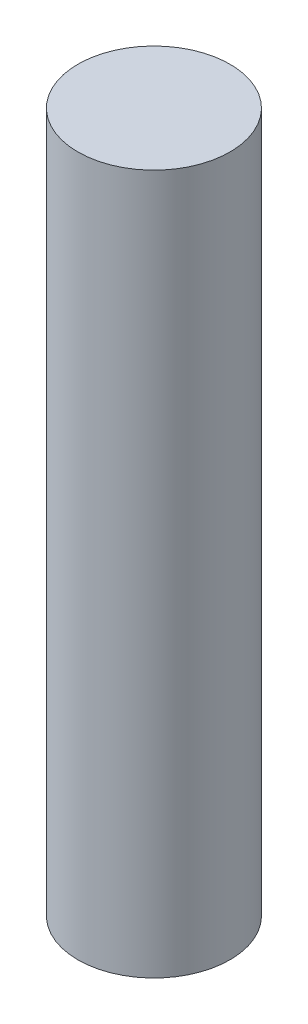
ISO-10303-21;
HEADER;
FILE_DESCRIPTION(('STEP AP214'),'2;1');
FILE_NAME('part.step','',(''),(''),'','','');
FILE_SCHEMA(('AUTOMOTIVE_DESIGN { 1 0 10303 214 1 1 1 1 }'));
ENDSEC;
DATA;
#1=APPLICATION_CONTEXT('core data for automotive mechanical design processes');
#2=APPLICATION_PROTOCOL_DEFINITION('international standard','automotive_design',2000,#1);
#3=PRODUCT_CONTEXT('',#1,'mechanical');
#4=PRODUCT('Part','Part','',(#3));
#5=PRODUCT_RELATED_PRODUCT_CATEGORY('part','',(#4));
#6=PRODUCT_DEFINITION_FORMATION('','',#4);
#7=PRODUCT_DEFINITION_CONTEXT('part definition',#1,'design');
#8=PRODUCT_DEFINITION('design','',#6,#7);
#9=PRODUCT_DEFINITION_SHAPE('','',#8);
#10=(LENGTH_UNIT() NAMED_UNIT(*) SI_UNIT(.MILLI.,.METRE.));
#11=(NAMED_UNIT(*) PLANE_ANGLE_UNIT() SI_UNIT($,.RADIAN.));
#12=(NAMED_UNIT(*) SI_UNIT($,.STERADIAN.) SOLID_ANGLE_UNIT());
#13=UNCERTAINTY_MEASURE_WITH_UNIT(LENGTH_MEASURE(1.E-05),#10,'distance_accuracy_value','');
#14=(GEOMETRIC_REPRESENTATION_CONTEXT(3) GLOBAL_UNCERTAINTY_ASSIGNED_CONTEXT((#13)) GLOBAL_UNIT_ASSIGNED_CONTEXT((#10,
#11,#12)) REPRESENTATION_CONTEXT('',''));
#15=CARTESIAN_POINT('',(0.,0.,0.));
#16=DIRECTION('',(0.,0.,1.));
#17=DIRECTION('',(1.,0.,0.));
#18=AXIS2_PLACEMENT_3D('',#15,#16,#17);
#19=CARTESIAN_POINT('',(0.,6.9,0.));
#20=DIRECTION('',(0.,-1.,0.));
#21=DIRECTION('',(0.,0.,-1.));
#22=AXIS2_PLACEMENT_3D('',#19,#20,#21);
#23=CYLINDRICAL_SURFACE('',#22,0.750000000000001);
#24=CARTESIAN_POINT('',(0.,6.9,0.));
#25=DIRECTION('',(0.,1.,0.));
#26=DIRECTION('',(0.,0.,1.));
#27=AXIS2_PLACEMENT_3D('',#24,#25,#26);
#28=CIRCLE('',#27,0.750000000000001);
#29=CARTESIAN_POINT('',(0.,6.9,0.750000000000001));
#30=VERTEX_POINT('',#29);
#31=EDGE_CURVE('E10',#30,#30,#28,.T.);
#32=ORIENTED_EDGE('',*,*,#31,.F.);
#33=EDGE_LOOP('',(#32));
#34=FACE_BOUND('',#33,.T.);
#35=CARTESIAN_POINT('',(0.,0.,0.));
#36=DIRECTION('',(0.,1.,0.));
#37=DIRECTION('',(0.,0.,1.));
#38=AXIS2_PLACEMENT_3D('',#35,#36,#37);
#39=CIRCLE('',#38,0.750000000000001);
#40=CARTESIAN_POINT('',(0.,0.,0.750000000000001));
#41=VERTEX_POINT('',#40);
#42=EDGE_CURVE('E34',#41,#41,#39,.T.);
#43=ORIENTED_EDGE('',*,*,#42,.T.);
#44=EDGE_LOOP('',(#43));
#45=FACE_BOUND('',#44,.T.);
#46=ADVANCED_FACE('F31',(#34,#45),#23,.T.);
#47=CARTESIAN_POINT('',(0.,6.9,0.));
#48=DIRECTION('',(0.,1.,0.));
#49=DIRECTION('',(0.,0.,1.));
#50=AXIS2_PLACEMENT_3D('',#47,#48,#49);
#51=PLANE('',#50);
#52=ORIENTED_EDGE('',*,*,#31,.T.);
#53=EDGE_LOOP('',(#52));
#54=FACE_BOUND('',#53,.T.);
#55=ADVANCED_FACE('F46',(#54),#51,.T.);
#56=CARTESIAN_POINT('',(0.,0.,0.));
#57=DIRECTION('',(0.,1.,0.));
#58=DIRECTION('',(0.,0.,1.));
#59=AXIS2_PLACEMENT_3D('',#56,#57,#58);
#60=PLANE('',#59);
#61=ORIENTED_EDGE('',*,*,#42,.F.);
#62=EDGE_LOOP('',(#61));
#63=FACE_BOUND('',#62,.T.);
#64=ADVANCED_FACE('F44',(#63),#60,.F.);
#65=CLOSED_SHELL('',(#46,#55,#64));
#66=MANIFOLD_SOLID_BREP('B2',#65);
#67=ADVANCED_BREP_SHAPE_REPRESENTATION('',(#18,#66),#14);
#68=SHAPE_DEFINITION_REPRESENTATION(#9,#67);
ENDSEC;
END-ISO-10303-21;
